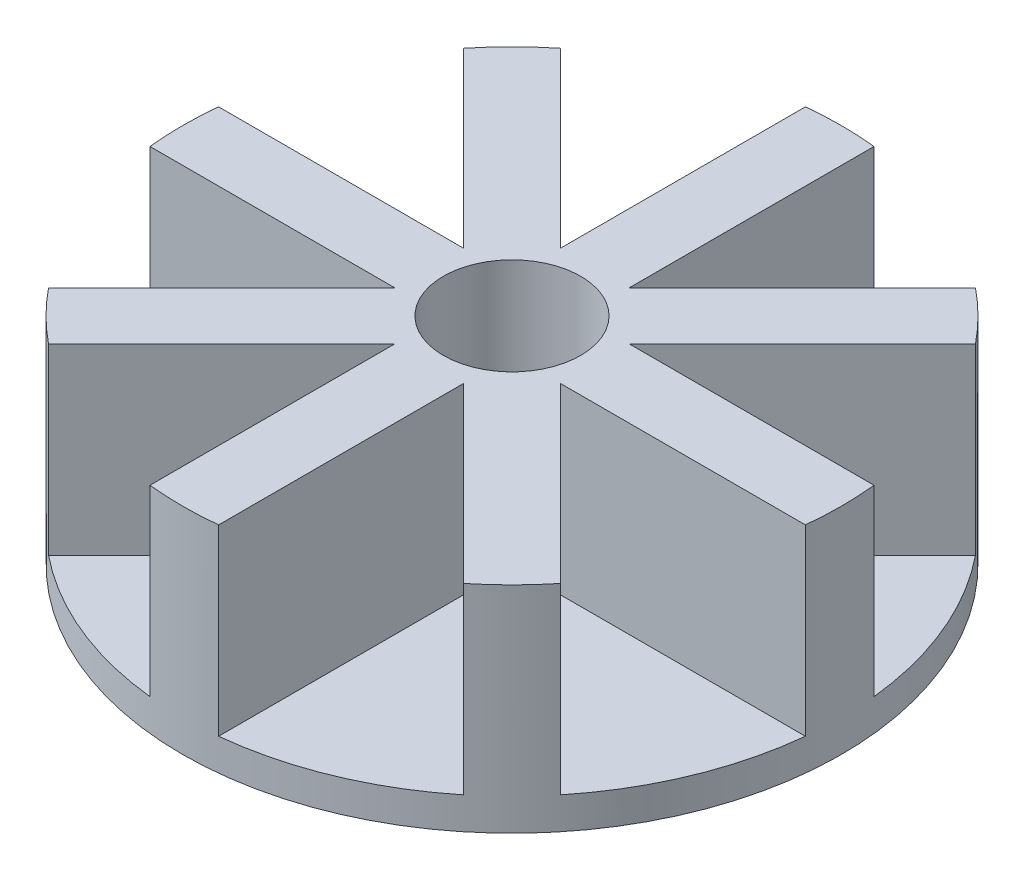
ISO-10303-21;
HEADER;
FILE_DESCRIPTION(('STEP AP214'),'2;1');
FILE_NAME('part.step','',(''),(''),'','','');
FILE_SCHEMA(('AUTOMOTIVE_DESIGN { 1 0 10303 214 1 1 1 1 }'));
ENDSEC;
DATA;
#1=APPLICATION_CONTEXT('core data for automotive mechanical design processes');
#2=APPLICATION_PROTOCOL_DEFINITION('international standard','automotive_design',2000,#1);
#3=PRODUCT_CONTEXT('',#1,'mechanical');
#4=PRODUCT('Part','Part','',(#3));
#5=PRODUCT_RELATED_PRODUCT_CATEGORY('part','',(#4));
#6=PRODUCT_DEFINITION_FORMATION('','',#4);
#7=PRODUCT_DEFINITION_CONTEXT('part definition',#1,'design');
#8=PRODUCT_DEFINITION('design','',#6,#7);
#9=PRODUCT_DEFINITION_SHAPE('','',#8);
#10=(LENGTH_UNIT() NAMED_UNIT(*) SI_UNIT(.MILLI.,.METRE.));
#11=(NAMED_UNIT(*) PLANE_ANGLE_UNIT() SI_UNIT($,.RADIAN.));
#12=(NAMED_UNIT(*) SI_UNIT($,.STERADIAN.) SOLID_ANGLE_UNIT());
#13=UNCERTAINTY_MEASURE_WITH_UNIT(LENGTH_MEASURE(1.E-05),#10,'distance_accuracy_value','');
#14=(GEOMETRIC_REPRESENTATION_CONTEXT(3) GLOBAL_UNCERTAINTY_ASSIGNED_CONTEXT((#13)) GLOBAL_UNIT_ASSIGNED_CONTEXT((#10,
#11,#12)) REPRESENTATION_CONTEXT('',''));
#15=CARTESIAN_POINT('',(0.,0.,0.));
#16=DIRECTION('',(0.,0.,1.));
#17=DIRECTION('',(1.,0.,0.));
#18=AXIS2_PLACEMENT_3D('',#15,#16,#17);
#19=CARTESIAN_POINT('',(0.,20.,0.));
#20=DIRECTION('',(0.,-1.,0.));
#21=DIRECTION('',(0.,0.,-1.));
#22=AXIS2_PLACEMENT_3D('',#19,#20,#21);
#23=CYLINDRICAL_SURFACE('',#22,4.);
#24=CARTESIAN_POINT('',(0.,0.,0.));
#25=DIRECTION('',(0.,-1.,0.));
#26=DIRECTION('',(0.,0.,-1.));
#27=AXIS2_PLACEMENT_3D('',#24,#25,#26);
#28=CIRCLE('',#27,4.);
#29=CARTESIAN_POINT('',(0.,0.,-4.));
#30=VERTEX_POINT('',#29);
#31=EDGE_CURVE('E416',#30,#30,#28,.T.);
#32=ORIENTED_EDGE('',*,*,#31,.T.);
#33=EDGE_LOOP('',(#32));
#34=FACE_BOUND('',#33,.T.);
#35=CARTESIAN_POINT('',(0.,14.,0.));
#36=DIRECTION('',(0.,1.,0.));
#37=DIRECTION('',(0.,0.,1.));
#38=AXIS2_PLACEMENT_3D('',#35,#36,#37);
#39=CIRCLE('',#38,4.);
#40=CARTESIAN_POINT('',(0.,14.,4.));
#41=VERTEX_POINT('',#40);
#42=EDGE_CURVE('E857',#41,#41,#39,.F.);
#43=ORIENTED_EDGE('',*,*,#42,.F.);
#44=EDGE_LOOP('',(#43));
#45=FACE_BOUND('',#44,.T.);
#46=ADVANCED_FACE('F105',(#34,#45),#23,.F.);
#47=CARTESIAN_POINT('',(15.5,94.001,-15.5));
#48=DIRECTION('',(0.,-1.,0.));
#49=DIRECTION('',(0.,0.,-1.));
#50=AXIS2_PLACEMENT_3D('',#47,#48,#49);
#51=CYLINDRICAL_SURFACE('',#50,1.4);
#52=CARTESIAN_POINT('',(15.5,0.,-15.5));
#53=DIRECTION('',(0.,-1.,0.));
#54=DIRECTION('',(0.,0.,-1.));
#55=AXIS2_PLACEMENT_3D('',#52,#53,#54);
#56=CIRCLE('',#55,1.4);
#57=CARTESIAN_POINT('',(15.5,0.,-16.9));
#58=VERTEX_POINT('',#57);
#59=EDGE_CURVE('E863',#58,#58,#56,.T.);
#60=ORIENTED_EDGE('',*,*,#59,.T.);
#61=EDGE_LOOP('',(#60));
#62=FACE_BOUND('',#61,.T.);
#63=CARTESIAN_POINT('',(15.5,14.,-15.5));
#64=DIRECTION('',(0.,1.,0.));
#65=DIRECTION('',(0.,0.,1.));
#66=AXIS2_PLACEMENT_3D('',#63,#64,#65);
#67=CIRCLE('',#66,1.4);
#68=CARTESIAN_POINT('',(15.5,14.,-14.1));
#69=VERTEX_POINT('',#68);
#70=EDGE_CURVE('E854',#69,#69,#67,.F.);
#71=ORIENTED_EDGE('',*,*,#70,.F.);
#72=EDGE_LOOP('',(#71));
#73=FACE_BOUND('',#72,.T.);
#74=ADVANCED_FACE('F466',(#62,#73),#51,.F.);
#75=CARTESIAN_POINT('',(15.5,94.001,15.5));
#76=DIRECTION('',(0.,-1.,0.));
#77=DIRECTION('',(0.,0.,-1.));
#78=AXIS2_PLACEMENT_3D('',#75,#76,#77);
#79=CYLINDRICAL_SURFACE('',#78,1.4);
#80=CARTESIAN_POINT('',(15.5,0.,15.5));
#81=DIRECTION('',(0.,-1.,0.));
#82=DIRECTION('',(0.,0.,-1.));
#83=AXIS2_PLACEMENT_3D('',#80,#81,#82);
#84=CIRCLE('',#83,1.4);
#85=CARTESIAN_POINT('',(15.5,0.,14.1));
#86=VERTEX_POINT('',#85);
#87=EDGE_CURVE('E860',#86,#86,#84,.T.);
#88=ORIENTED_EDGE('',*,*,#87,.T.);
#89=EDGE_LOOP('',(#88));
#90=FACE_BOUND('',#89,.T.);
#91=CARTESIAN_POINT('',(15.5,14.,15.5));
#92=DIRECTION('',(0.,1.,0.));
#93=DIRECTION('',(0.,0.,1.));
#94=AXIS2_PLACEMENT_3D('',#91,#92,#93);
#95=CIRCLE('',#94,1.4);
#96=CARTESIAN_POINT('',(15.5,14.,16.9));
#97=VERTEX_POINT('',#96);
#98=EDGE_CURVE('E843',#97,#97,#95,.F.);
#99=ORIENTED_EDGE('',*,*,#98,.F.);
#100=EDGE_LOOP('',(#99));
#101=FACE_BOUND('',#100,.T.);
#102=ADVANCED_FACE('F472',(#90,#101),#79,.F.);
#103=CARTESIAN_POINT('',(-15.5,94.001,15.5));
#104=DIRECTION('',(0.,-1.,0.));
#105=DIRECTION('',(0.,0.,-1.));
#106=AXIS2_PLACEMENT_3D('',#103,#104,#105);
#107=CYLINDRICAL_SURFACE('',#106,1.4);
#108=CARTESIAN_POINT('',(-15.5,0.,15.5));
#109=DIRECTION('',(0.,-1.,0.));
#110=DIRECTION('',(0.,0.,-1.));
#111=AXIS2_PLACEMENT_3D('',#108,#109,#110);
#112=CIRCLE('',#111,1.4);
#113=CARTESIAN_POINT('',(-15.5,0.,14.1));
#114=VERTEX_POINT('',#113);
#115=EDGE_CURVE('E864',#114,#114,#112,.T.);
#116=ORIENTED_EDGE('',*,*,#115,.T.);
#117=EDGE_LOOP('',(#116));
#118=FACE_BOUND('',#117,.T.);
#119=CARTESIAN_POINT('',(-15.5,14.,15.5));
#120=DIRECTION('',(0.,1.,0.));
#121=DIRECTION('',(0.,0.,1.));
#122=AXIS2_PLACEMENT_3D('',#119,#120,#121);
#123=CIRCLE('',#122,1.4);
#124=CARTESIAN_POINT('',(-15.5,14.,16.9));
#125=VERTEX_POINT('',#124);
#126=EDGE_CURVE('E840',#125,#125,#123,.F.);
#127=ORIENTED_EDGE('',*,*,#126,.F.);
#128=EDGE_LOOP('',(#127));
#129=FACE_BOUND('',#128,.T.);
#130=ADVANCED_FACE('F745',(#118,#129),#107,.F.);
#131=CARTESIAN_POINT('',(-15.5,94.001,-15.5));
#132=DIRECTION('',(0.,-1.,0.));
#133=DIRECTION('',(0.,0.,-1.));
#134=AXIS2_PLACEMENT_3D('',#131,#132,#133);
#135=CYLINDRICAL_SURFACE('',#134,1.4);
#136=CARTESIAN_POINT('',(-15.5,0.,-15.5));
#137=DIRECTION('',(0.,-1.,0.));
#138=DIRECTION('',(0.,0.,-1.));
#139=AXIS2_PLACEMENT_3D('',#136,#137,#138);
#140=CIRCLE('',#139,1.4);
#141=CARTESIAN_POINT('',(-15.5,0.,-16.9));
#142=VERTEX_POINT('',#141);
#143=EDGE_CURVE('E836',#142,#142,#140,.T.);
#144=ORIENTED_EDGE('',*,*,#143,.T.);
#145=EDGE_LOOP('',(#144));
#146=FACE_BOUND('',#145,.T.);
#147=CARTESIAN_POINT('',(-15.5,14.,-15.5));
#148=DIRECTION('',(0.,1.,0.));
#149=DIRECTION('',(0.,0.,1.));
#150=AXIS2_PLACEMENT_3D('',#147,#148,#149);
#151=CIRCLE('',#150,1.4);
#152=CARTESIAN_POINT('',(-15.5,14.,-14.1));
#153=VERTEX_POINT('',#152);
#154=EDGE_CURVE('E109',#153,#153,#151,.F.);
#155=ORIENTED_EDGE('',*,*,#154,.F.);
#156=EDGE_LOOP('',(#155));
#157=FACE_BOUND('',#156,.T.);
#158=ADVANCED_FACE('F754',(#146,#157),#135,.F.);
#159=CARTESIAN_POINT('',(0.,94.,0.));
#160=DIRECTION('',(0.,-1.,0.));
#161=DIRECTION('',(0.,0.,-1.));
#162=AXIS2_PLACEMENT_3D('',#159,#160,#161);
#163=CYLINDRICAL_SURFACE('',#162,144.);
#164=CARTESIAN_POINT('',(0.,0.,0.));
#165=DIRECTION('',(0.,1.,0.));
#166=DIRECTION('',(0.,0.,1.));
#167=AXIS2_PLACEMENT_3D('',#164,#165,#166);
#168=CIRCLE('',#167,144.);
#169=CARTESIAN_POINT('',(0.,0.,144.));
#170=VERTEX_POINT('',#169);
#171=EDGE_CURVE('E440',#170,#170,#168,.T.);
#172=ORIENTED_EDGE('',*,*,#171,.T.);
#173=EDGE_LOOP('',(#172));
#174=FACE_BOUND('',#173,.T.);
#175=DIRECTION('',(0.,1.,0.));
#176=VECTOR('',#175,1.);
#177=CARTESIAN_POINT('',(-111.876044295508,14.,-90.6628408599112));
#178=LINE('',#177,#176);
#179=CARTESIAN_POINT('',(-111.876044295508,14.,-90.6628408599112));
#180=VERTEX_POINT('',#179);
#181=CARTESIAN_POINT('',(-111.876044295508,94.,-90.6628408599112));
#182=VERTEX_POINT('',#181);
#183=EDGE_CURVE('E412',#180,#182,#178,.T.);
#184=ORIENTED_EDGE('',*,*,#183,.T.);
#185=CARTESIAN_POINT('',(0.,94.,0.));
#186=DIRECTION('',(0.,1.,0.));
#187=DIRECTION('',(0.,0.,1.));
#188=AXIS2_PLACEMENT_3D('',#185,#186,#187);
#189=CIRCLE('',#188,144.);
#190=CARTESIAN_POINT('',(-90.6628408599113,94.,-111.876044295508));
#191=VERTEX_POINT('',#190);
#192=EDGE_CURVE('E579',#191,#182,#189,.T.);
#193=ORIENTED_EDGE('',*,*,#192,.F.);
#194=DIRECTION('',(0.,1.,0.));
#195=VECTOR('',#194,1.);
#196=CARTESIAN_POINT('',(-90.6628408599113,14.,-111.876044295508));
#197=LINE('',#196,#195);
#198=CARTESIAN_POINT('',(-90.6628408599113,14.,-111.876044295508));
#199=VERTEX_POINT('',#198);
#200=EDGE_CURVE('E432',#199,#191,#197,.T.);
#201=ORIENTED_EDGE('',*,*,#200,.F.);
#202=CARTESIAN_POINT('',(0.,14.,0.));
#203=DIRECTION('',(0.,1.,0.));
#204=DIRECTION('',(0.,0.,1.));
#205=AXIS2_PLACEMENT_3D('',#202,#203,#204);
#206=CIRCLE('',#205,144.);
#207=CARTESIAN_POINT('',(-15.,14.,-143.21661914736));
#208=VERTEX_POINT('',#207);
#209=EDGE_CURVE('E423',#208,#199,#206,.T.);
#210=ORIENTED_EDGE('',*,*,#209,.F.);
#211=DIRECTION('',(0.,1.,0.));
#212=VECTOR('',#211,1.);
#213=CARTESIAN_POINT('',(-15.,14.,-143.21661914736));
#214=LINE('',#213,#212);
#215=CARTESIAN_POINT('',(-15.,94.,-143.21661914736));
#216=VERTEX_POINT('',#215);
#217=EDGE_CURVE('E437',#208,#216,#214,.T.);
#218=ORIENTED_EDGE('',*,*,#217,.T.);
#219=CARTESIAN_POINT('',(15.,94.,-143.21661914736));
#220=VERTEX_POINT('',#219);
#221=EDGE_CURVE('E575',#220,#216,#189,.T.);
#222=ORIENTED_EDGE('',*,*,#221,.F.);
#223=DIRECTION('',(0.,1.,0.));
#224=VECTOR('',#223,1.);
#225=CARTESIAN_POINT('',(15.,14.,-143.21661914736));
#226=LINE('',#225,#224);
#227=CARTESIAN_POINT('',(15.,14.,-143.21661914736));
#228=VERTEX_POINT('',#227);
#229=EDGE_CURVE('E324',#228,#220,#226,.T.);
#230=ORIENTED_EDGE('',*,*,#229,.F.);
#231=CARTESIAN_POINT('',(0.,14.,0.));
#232=DIRECTION('',(0.,1.,0.));
#233=DIRECTION('',(0.,0.,1.));
#234=AXIS2_PLACEMENT_3D('',#231,#232,#233);
#235=CIRCLE('',#234,144.);
#236=CARTESIAN_POINT('',(90.6628408599113,14.,-111.876044295508));
#237=VERTEX_POINT('',#236);
#238=EDGE_CURVE('E310',#237,#228,#235,.T.);
#239=ORIENTED_EDGE('',*,*,#238,.F.);
#240=DIRECTION('',(0.,1.,0.));
#241=VECTOR('',#240,1.);
#242=CARTESIAN_POINT('',(90.6628408599113,14.,-111.876044295508));
#243=LINE('',#242,#241);
#244=CARTESIAN_POINT('',(90.6628408599113,94.,-111.876044295508));
#245=VERTEX_POINT('',#244);
#246=EDGE_CURVE('E316',#237,#245,#243,.T.);
#247=ORIENTED_EDGE('',*,*,#246,.T.);
#248=CARTESIAN_POINT('',(111.876044295508,94.,-90.6628408599113));
#249=VERTEX_POINT('',#248);
#250=EDGE_CURVE('E582',#249,#245,#189,.T.);
#251=ORIENTED_EDGE('',*,*,#250,.F.);
#252=DIRECTION('',(0.,1.,0.));
#253=VECTOR('',#252,1.);
#254=CARTESIAN_POINT('',(111.876044295508,14.,-90.6628408599113));
#255=LINE('',#254,#253);
#256=CARTESIAN_POINT('',(111.876044295508,14.,-90.6628408599113));
#257=VERTEX_POINT('',#256);
#258=EDGE_CURVE('E283',#257,#249,#255,.T.);
#259=ORIENTED_EDGE('',*,*,#258,.F.);
#260=CARTESIAN_POINT('',(0.,14.,0.));
#261=DIRECTION('',(0.,1.,0.));
#262=DIRECTION('',(0.,0.,1.));
#263=AXIS2_PLACEMENT_3D('',#260,#261,#262);
#264=CIRCLE('',#263,144.);
#265=CARTESIAN_POINT('',(143.21661914736,14.,-15.));
#266=VERTEX_POINT('',#265);
#267=EDGE_CURVE('E289',#266,#257,#264,.T.);
#268=ORIENTED_EDGE('',*,*,#267,.F.);
#269=DIRECTION('',(0.,1.,0.));
#270=VECTOR('',#269,1.);
#271=CARTESIAN_POINT('',(143.21661914736,14.,-15.));
#272=LINE('',#271,#270);
#273=CARTESIAN_POINT('',(143.21661914736,94.,-15.));
#274=VERTEX_POINT('',#273);
#275=EDGE_CURVE('E272',#266,#274,#272,.T.);
#276=ORIENTED_EDGE('',*,*,#275,.T.);
#277=CARTESIAN_POINT('',(143.21661914736,94.,15.));
#278=VERTEX_POINT('',#277);
#279=EDGE_CURVE('E114',#278,#274,#189,.T.);
#280=ORIENTED_EDGE('',*,*,#279,.F.);
#281=DIRECTION('',(0.,1.,0.));
#282=VECTOR('',#281,1.);
#283=CARTESIAN_POINT('',(143.21661914736,14.,15.));
#284=LINE('',#283,#282);
#285=CARTESIAN_POINT('',(143.21661914736,14.,15.));
#286=VERTEX_POINT('',#285);
#287=EDGE_CURVE('E364',#286,#278,#284,.T.);
#288=ORIENTED_EDGE('',*,*,#287,.F.);
#289=CARTESIAN_POINT('',(0.,14.,0.));
#290=DIRECTION('',(0.,1.,0.));
#291=DIRECTION('',(0.,0.,1.));
#292=AXIS2_PLACEMENT_3D('',#289,#290,#291);
#293=CIRCLE('',#292,144.);
#294=CARTESIAN_POINT('',(111.876044295508,14.,90.6628408599112));
#295=VERTEX_POINT('',#294);
#296=EDGE_CURVE('E352',#295,#286,#293,.T.);
#297=ORIENTED_EDGE('',*,*,#296,.F.);
#298=DIRECTION('',(0.,1.,0.));
#299=VECTOR('',#298,1.);
#300=CARTESIAN_POINT('',(111.876044295508,14.,90.6628408599112));
#301=LINE('',#300,#299);
#302=CARTESIAN_POINT('',(111.876044295508,94.,90.6628408599112));
#303=VERTEX_POINT('',#302);
#304=EDGE_CURVE('E358',#295,#303,#301,.T.);
#305=ORIENTED_EDGE('',*,*,#304,.T.);
#306=CARTESIAN_POINT('',(90.6628408599113,94.,111.876044295508));
#307=VERTEX_POINT('',#306);
#308=EDGE_CURVE('E12',#307,#303,#189,.T.);
#309=ORIENTED_EDGE('',*,*,#308,.F.);
#310=DIRECTION('',(0.,1.,0.));
#311=VECTOR('',#310,1.);
#312=CARTESIAN_POINT('',(90.6628408599113,14.,111.876044295508));
#313=LINE('',#312,#311);
#314=CARTESIAN_POINT('',(90.6628408599113,14.,111.876044295508));
#315=VERTEX_POINT('',#314);
#316=EDGE_CURVE('E346',#315,#307,#313,.T.);
#317=ORIENTED_EDGE('',*,*,#316,.F.);
#318=CARTESIAN_POINT('',(0.,14.,0.));
#319=DIRECTION('',(0.,1.,0.));
#320=DIRECTION('',(0.,0.,1.));
#321=AXIS2_PLACEMENT_3D('',#318,#319,#320);
#322=CIRCLE('',#321,144.);
#323=CARTESIAN_POINT('',(15.,14.,143.21661914736));
#324=VERTEX_POINT('',#323);
#325=EDGE_CURVE('E330',#324,#315,#322,.T.);
#326=ORIENTED_EDGE('',*,*,#325,.F.);
#327=DIRECTION('',(0.,1.,0.));
#328=VECTOR('',#327,1.);
#329=CARTESIAN_POINT('',(15.,14.,143.21661914736));
#330=LINE('',#329,#328);
#331=CARTESIAN_POINT('',(15.,94.,143.21661914736));
#332=VERTEX_POINT('',#331);
#333=EDGE_CURVE('E336',#324,#332,#330,.T.);
#334=ORIENTED_EDGE('',*,*,#333,.T.);
#335=CARTESIAN_POINT('',(-15.,94.,143.21661914736));
#336=VERTEX_POINT('',#335);
#337=EDGE_CURVE('E116',#336,#332,#189,.T.);
#338=ORIENTED_EDGE('',*,*,#337,.F.);
#339=DIRECTION('',(0.,1.,0.));
#340=VECTOR('',#339,1.);
#341=CARTESIAN_POINT('',(-15.,14.,143.21661914736));
#342=LINE('',#341,#340);
#343=CARTESIAN_POINT('',(-15.,14.,143.21661914736));
#344=VERTEX_POINT('',#343);
#345=EDGE_CURVE('E123',#344,#336,#342,.T.);
#346=ORIENTED_EDGE('',*,*,#345,.F.);
#347=CARTESIAN_POINT('',(0.,14.,0.));
#348=DIRECTION('',(0.,1.,0.));
#349=DIRECTION('',(0.,0.,1.));
#350=AXIS2_PLACEMENT_3D('',#347,#348,#349);
#351=CIRCLE('',#350,144.);
#352=CARTESIAN_POINT('',(-90.6628408599113,14.,111.876044295508));
#353=VERTEX_POINT('',#352);
#354=EDGE_CURVE('E390',#353,#344,#351,.T.);
#355=ORIENTED_EDGE('',*,*,#354,.F.);
#356=DIRECTION('',(0.,1.,0.));
#357=VECTOR('',#356,1.);
#358=CARTESIAN_POINT('',(-90.6628408599113,14.,111.876044295508));
#359=LINE('',#358,#357);
#360=CARTESIAN_POINT('',(-90.6628408599113,94.,111.876044295508));
#361=VERTEX_POINT('',#360);
#362=EDGE_CURVE('E396',#353,#361,#359,.T.);
#363=ORIENTED_EDGE('',*,*,#362,.T.);
#364=CARTESIAN_POINT('',(-111.876044295508,94.,90.6628408599113));
#365=VERTEX_POINT('',#364);
#366=EDGE_CURVE('E444',#365,#361,#189,.T.);
#367=ORIENTED_EDGE('',*,*,#366,.F.);
#368=DIRECTION('',(0.,1.,0.));
#369=VECTOR('',#368,1.);
#370=CARTESIAN_POINT('',(-111.876044295508,14.,90.6628408599113));
#371=LINE('',#370,#369);
#372=CARTESIAN_POINT('',(-111.876044295508,14.,90.6628408599113));
#373=VERTEX_POINT('',#372);
#374=EDGE_CURVE('E131',#373,#365,#371,.T.);
#375=ORIENTED_EDGE('',*,*,#374,.F.);
#376=CARTESIAN_POINT('',(0.,14.,0.));
#377=DIRECTION('',(0.,1.,0.));
#378=DIRECTION('',(0.,0.,1.));
#379=AXIS2_PLACEMENT_3D('',#376,#377,#378);
#380=CIRCLE('',#379,144.);
#381=CARTESIAN_POINT('',(-143.21661914736,14.,15.));
#382=VERTEX_POINT('',#381);
#383=EDGE_CURVE('E370',#382,#373,#380,.T.);
#384=ORIENTED_EDGE('',*,*,#383,.F.);
#385=DIRECTION('',(0.,1.,0.));
#386=VECTOR('',#385,1.);
#387=CARTESIAN_POINT('',(-143.21661914736,14.,15.));
#388=LINE('',#387,#386);
#389=CARTESIAN_POINT('',(-143.21661914736,94.,15.));
#390=VERTEX_POINT('',#389);
#391=EDGE_CURVE('E376',#382,#390,#388,.T.);
#392=ORIENTED_EDGE('',*,*,#391,.T.);
#393=CARTESIAN_POINT('',(-143.21661914736,94.,-15.));
#394=VERTEX_POINT('',#393);
#395=EDGE_CURVE('E581',#394,#390,#189,.T.);
#396=ORIENTED_EDGE('',*,*,#395,.F.);
#397=DIRECTION('',(0.,1.,0.));
#398=VECTOR('',#397,1.);
#399=CARTESIAN_POINT('',(-143.21661914736,14.,-15.));
#400=LINE('',#399,#398);
#401=CARTESIAN_POINT('',(-143.21661914736,14.,-15.));
#402=VERTEX_POINT('',#401);
#403=EDGE_CURVE('E420',#402,#394,#400,.T.);
#404=ORIENTED_EDGE('',*,*,#403,.F.);
#405=CARTESIAN_POINT('',(0.,14.,0.));
#406=DIRECTION('',(0.,1.,0.));
#407=DIRECTION('',(0.,0.,1.));
#408=AXIS2_PLACEMENT_3D('',#405,#406,#407);
#409=CIRCLE('',#408,144.);
#410=EDGE_CURVE('E406',#180,#402,#409,.T.);
#411=ORIENTED_EDGE('',*,*,#410,.F.);
#412=EDGE_LOOP('',(#184,#193,#201,#210,#218,#222,#230,#239,#247,#251,#259,#268,#276,#280,#288,
#297,#305,#309,#317,#326,#334,#338,#346,#355,#363,#367,#375,#384,#392,#396,#404,#411));
#413=FACE_BOUND('',#412,.T.);
#414=ADVANCED_FACE('F107',(#174,#413),#163,.T.);
#415=CARTESIAN_POINT('',(0.,94.,0.));
#416=DIRECTION('',(0.,1.,0.));
#417=DIRECTION('',(0.,0.,1.));
#418=AXIS2_PLACEMENT_3D('',#415,#416,#417);
#419=PLANE('',#418);
#420=CARTESIAN_POINT('',(0.,94.,0.));
#421=DIRECTION('',(0.,1.,0.));
#422=DIRECTION('',(0.,0.,1.));
#423=AXIS2_PLACEMENT_3D('',#420,#421,#422);
#424=CIRCLE('',#423,30.);
#425=CARTESIAN_POINT('',(0.,94.,30.));
#426=VERTEX_POINT('',#425);
#427=EDGE_CURVE('E846',#426,#426,#424,.T.);
#428=ORIENTED_EDGE('',*,*,#427,.F.);
#429=EDGE_LOOP('',(#428));
#430=FACE_BOUND('',#429,.T.);
#431=ORIENTED_EDGE('',*,*,#192,.T.);
#432=DIRECTION('',(0.70710678118655,0.,0.707106781186545));
#433=VECTOR('',#432,1.);
#434=CARTESIAN_POINT('',(-10.6066017177978,94.,10.6066017177979));
#435=LINE('',#434,#433);
#436=CARTESIAN_POINT('',(-36.2132034355962,94.,-15.0000000000003));
#437=VERTEX_POINT('',#436);
#438=EDGE_CURVE('E413',#182,#437,#435,.T.);
#439=ORIENTED_EDGE('',*,*,#438,.T.);
#440=DIRECTION('',(1.,0.,0.));
#441=VECTOR('',#440,1.);
#442=CARTESIAN_POINT('',(0.,94.,-15.0000000000004));
#443=LINE('',#442,#441);
#444=EDGE_CURVE('E407',#394,#437,#443,.T.);
#445=ORIENTED_EDGE('',*,*,#444,.F.);
#446=ORIENTED_EDGE('',*,*,#395,.T.);
#447=DIRECTION('',(1.,0.,0.));
#448=VECTOR('',#447,1.);
#449=CARTESIAN_POINT('',(0.,94.,14.9999999999996));
#450=LINE('',#449,#448);
#451=CARTESIAN_POINT('',(-36.2132034355965,94.,14.9999999999997));
#452=VERTEX_POINT('',#451);
#453=EDGE_CURVE('E377',#390,#452,#450,.T.);
#454=ORIENTED_EDGE('',*,*,#453,.T.);
#455=DIRECTION('',(0.707106781186546,0.,-0.707106781186549));
#456=VECTOR('',#455,1.);
#457=CARTESIAN_POINT('',(-10.6066017177985,94.,-10.6066017177984));
#458=LINE('',#457,#456);
#459=EDGE_CURVE('E371',#365,#452,#458,.T.);
#460=ORIENTED_EDGE('',*,*,#459,.F.);
#461=ORIENTED_EDGE('',*,*,#366,.T.);
#462=DIRECTION('',(0.707106781186546,0.,-0.70710678118655));
#463=VECTOR('',#462,1.);
#464=CARTESIAN_POINT('',(10.606601717798,94.,10.6066017177979));
#465=LINE('',#464,#463);
#466=CARTESIAN_POINT('',(-15.0000000000002,94.,36.2132034355963));
#467=VERTEX_POINT('',#466);
#468=EDGE_CURVE('E384',#361,#467,#465,.T.);
#469=ORIENTED_EDGE('',*,*,#468,.T.);
#470=DIRECTION('',(0.,0.,-1.));
#471=VECTOR('',#470,1.);
#472=CARTESIAN_POINT('',(-15.0000000000003,94.,0.));
#473=LINE('',#472,#471);
#474=EDGE_CURVE('E391',#336,#467,#473,.T.);
#475=ORIENTED_EDGE('',*,*,#474,.F.);
#476=ORIENTED_EDGE('',*,*,#337,.T.);
#477=DIRECTION('',(0.,0.,-1.));
#478=VECTOR('',#477,1.);
#479=CARTESIAN_POINT('',(14.9999999999997,94.,0.));
#480=LINE('',#479,#478);
#481=CARTESIAN_POINT('',(14.9999999999998,94.,36.2132034355964));
#482=VERTEX_POINT('',#481);
#483=EDGE_CURVE('E337',#332,#482,#480,.T.);
#484=ORIENTED_EDGE('',*,*,#483,.T.);
#485=DIRECTION('',(-0.707106781186549,0.,-0.707106781186546));
#486=VECTOR('',#485,1.);
#487=CARTESIAN_POINT('',(-10.6066017177983,94.,10.6066017177984));
#488=LINE('',#487,#486);
#489=EDGE_CURVE('E331',#307,#482,#488,.T.);
#490=ORIENTED_EDGE('',*,*,#489,.F.);
#491=ORIENTED_EDGE('',*,*,#308,.T.);
#492=DIRECTION('',(-0.707106781186549,0.,-0.707106781186546));
#493=VECTOR('',#492,1.);
#494=CARTESIAN_POINT('',(10.606601717798,94.,-10.6066017177981));
#495=LINE('',#494,#493);
#496=CARTESIAN_POINT('',(36.2132034355963,94.,15.0000000000001));
#497=VERTEX_POINT('',#496);
#498=EDGE_CURVE('E345',#303,#497,#495,.T.);
#499=ORIENTED_EDGE('',*,*,#498,.T.);
#500=DIRECTION('',(-1.,0.,0.));
#501=VECTOR('',#500,1.);
#502=CARTESIAN_POINT('',(0.,94.,15.0000000000001));
#503=LINE('',#502,#501);
#504=EDGE_CURVE('E353',#278,#497,#503,.T.);
#505=ORIENTED_EDGE('',*,*,#504,.F.);
#506=ORIENTED_EDGE('',*,*,#279,.T.);
#507=DIRECTION('',(-1.,0.,0.));
#508=VECTOR('',#507,1.);
#509=CARTESIAN_POINT('',(0.,94.,-14.9999999999999));
#510=LINE('',#509,#508);
#511=CARTESIAN_POINT('',(36.2132034355964,94.,-14.9999999999999));
#512=VERTEX_POINT('',#511);
#513=EDGE_CURVE('E278',#274,#512,#510,.T.);
#514=ORIENTED_EDGE('',*,*,#513,.T.);
#515=DIRECTION('',(-0.707106781186547,0.,0.707106781186548));
#516=VECTOR('',#515,1.);
#517=CARTESIAN_POINT('',(10.6066017177983,94.,10.6066017177982));
#518=LINE('',#517,#516);
#519=EDGE_CURVE('E291',#249,#512,#518,.T.);
#520=ORIENTED_EDGE('',*,*,#519,.F.);
#521=ORIENTED_EDGE('',*,*,#250,.T.);
#522=DIRECTION('',(-0.707106781186547,0.,0.707106781186548));
#523=VECTOR('',#522,1.);
#524=CARTESIAN_POINT('',(-10.6066017177982,94.,-10.6066017177981));
#525=LINE('',#524,#523);
#526=CARTESIAN_POINT('',(15.,94.,-36.2132034355963));
#527=VERTEX_POINT('',#526);
#528=EDGE_CURVE('E306',#245,#527,#525,.T.);
#529=ORIENTED_EDGE('',*,*,#528,.T.);
#530=DIRECTION('',(0.,0.,1.));
#531=VECTOR('',#530,1.);
#532=CARTESIAN_POINT('',(15.,94.,0.));
#533=LINE('',#532,#531);
#534=EDGE_CURVE('E311',#220,#527,#533,.T.);
#535=ORIENTED_EDGE('',*,*,#534,.F.);
#536=ORIENTED_EDGE('',*,*,#221,.T.);
#537=DIRECTION('',(0.,0.,1.));
#538=VECTOR('',#537,1.);
#539=CARTESIAN_POINT('',(-15.,94.,0.));
#540=LINE('',#539,#538);
#541=CARTESIAN_POINT('',(-15.,94.,-36.2132034355969));
#542=VERTEX_POINT('',#541);
#543=EDGE_CURVE('E427',#216,#542,#540,.T.);
#544=ORIENTED_EDGE('',*,*,#543,.T.);
#545=DIRECTION('',(0.70710678118655,0.,0.707106781186545));
#546=VECTOR('',#545,1.);
#547=CARTESIAN_POINT('',(10.6066017177985,94.,-10.6066017177986));
#548=LINE('',#547,#546);
#549=EDGE_CURVE('E323',#191,#542,#548,.T.);
#550=ORIENTED_EDGE('',*,*,#549,.F.);
#551=EDGE_LOOP('',(#431,#439,#445,#446,#454,#460,#461,#469,#475,#476,#484,#490,#491,#499,#505,
#506,#514,#520,#521,#529,#535,#536,#544,#550));
#552=FACE_BOUND('',#551,.T.);
#553=ADVANCED_FACE('F452',(#430,#552),#419,.T.);
#554=CARTESIAN_POINT('',(0.,0.,0.));
#555=DIRECTION('',(0.,1.,0.));
#556=DIRECTION('',(0.,0.,1.));
#557=AXIS2_PLACEMENT_3D('',#554,#555,#556);
#558=PLANE('',#557);
#559=ORIENTED_EDGE('',*,*,#143,.F.);
#560=EDGE_LOOP('',(#559));
#561=FACE_BOUND('',#560,.T.);
#562=ORIENTED_EDGE('',*,*,#115,.F.);
#563=EDGE_LOOP('',(#562));
#564=FACE_BOUND('',#563,.T.);
#565=ORIENTED_EDGE('',*,*,#87,.F.);
#566=EDGE_LOOP('',(#565));
#567=FACE_BOUND('',#566,.T.);
#568=ORIENTED_EDGE('',*,*,#59,.F.);
#569=EDGE_LOOP('',(#568));
#570=FACE_BOUND('',#569,.T.);
#571=ORIENTED_EDGE('',*,*,#31,.F.);
#572=EDGE_LOOP('',(#571));
#573=FACE_BOUND('',#572,.T.);
#574=ORIENTED_EDGE('',*,*,#171,.F.);
#575=EDGE_LOOP('',(#574));
#576=FACE_BOUND('',#575,.T.);
#577=ADVANCED_FACE('F449',(#561,#564,#567,#570,#573,#576),#558,.F.);
#578=CARTESIAN_POINT('',(-15.,14.,0.));
#579=DIRECTION('',(-1.,0.,0.));
#580=DIRECTION('',(0.,0.,1.));
#581=AXIS2_PLACEMENT_3D('',#578,#579,#580);
#582=PLANE('',#581);
#583=ORIENTED_EDGE('',*,*,#543,.F.);
#584=ORIENTED_EDGE('',*,*,#217,.F.);
#585=DIRECTION('',(0.,0.,1.));
#586=VECTOR('',#585,1.);
#587=CARTESIAN_POINT('',(-15.,14.,0.));
#588=LINE('',#587,#586);
#589=CARTESIAN_POINT('',(-15.,14.,-36.2132034355969));
#590=VERTEX_POINT('',#589);
#591=EDGE_CURVE('E430',#208,#590,#588,.T.);
#592=ORIENTED_EDGE('',*,*,#591,.T.);
#593=DIRECTION('',(0.,1.,0.));
#594=VECTOR('',#593,1.);
#595=CARTESIAN_POINT('',(-15.,14.,-36.2132034355969));
#596=LINE('',#595,#594);
#597=EDGE_CURVE('E441',#590,#542,#596,.T.);
#598=ORIENTED_EDGE('',*,*,#597,.T.);
#599=EDGE_LOOP('',(#583,#584,#592,#598));
#600=FACE_BOUND('',#599,.T.);
#601=ADVANCED_FACE('F451',(#600),#582,.T.);
#602=CARTESIAN_POINT('',(10.6066017177985,14.,-10.6066017177986));
#603=DIRECTION('',(-0.707106781186545,0.,0.70710678118655));
#604=DIRECTION('',(0.70710678118655,0.,0.707106781186545));
#605=AXIS2_PLACEMENT_3D('',#602,#603,#604);
#606=PLANE('',#605);
#607=ORIENTED_EDGE('',*,*,#549,.T.);
#608=ORIENTED_EDGE('',*,*,#597,.F.);
#609=DIRECTION('',(0.70710678118655,0.,0.707106781186545));
#610=VECTOR('',#609,1.);
#611=CARTESIAN_POINT('',(10.6066017177985,14.,-10.6066017177986));
#612=LINE('',#611,#610);
#613=EDGE_CURVE('E426',#199,#590,#612,.T.);
#614=ORIENTED_EDGE('',*,*,#613,.F.);
#615=ORIENTED_EDGE('',*,*,#200,.T.);
#616=EDGE_LOOP('',(#607,#608,#614,#615));
#617=FACE_BOUND('',#616,.T.);
#618=ADVANCED_FACE('F458',(#617),#606,.F.);
#619=CARTESIAN_POINT('',(0.,14.,0.));
#620=DIRECTION('',(0.,1.,0.));
#621=DIRECTION('',(0.,0.,1.));
#622=AXIS2_PLACEMENT_3D('',#619,#620,#621);
#623=PLANE('',#622);
#624=ORIENTED_EDGE('',*,*,#209,.T.);
#625=ORIENTED_EDGE('',*,*,#613,.T.);
#626=ORIENTED_EDGE('',*,*,#591,.F.);
#627=EDGE_LOOP('',(#624,#625,#626));
#628=FACE_BOUND('',#627,.T.);
#629=ADVANCED_FACE('F488',(#628),#623,.T.);
#630=CARTESIAN_POINT('',(0.,14.,-14.9999999999999));
#631=DIRECTION('',(0.,0.,-1.));
#632=DIRECTION('',(-1.,0.,0.));
#633=AXIS2_PLACEMENT_3D('',#630,#631,#632);
#634=PLANE('',#633);
#635=ORIENTED_EDGE('',*,*,#513,.F.);
#636=ORIENTED_EDGE('',*,*,#275,.F.);
#637=DIRECTION('',(-1.,0.,0.));
#638=VECTOR('',#637,1.);
#639=CARTESIAN_POINT('',(0.,14.,-14.9999999999999));
#640=LINE('',#639,#638);
#641=CARTESIAN_POINT('',(36.2132034355964,14.,-14.9999999999999));
#642=VERTEX_POINT('',#641);
#643=EDGE_CURVE('E275',#266,#642,#640,.T.);
#644=ORIENTED_EDGE('',*,*,#643,.T.);
#645=DIRECTION('',(0.,1.,0.));
#646=VECTOR('',#645,1.);
#647=CARTESIAN_POINT('',(36.2132034355964,14.,-14.9999999999999));
#648=LINE('',#647,#646);
#649=EDGE_CURVE('E304',#642,#512,#648,.T.);
#650=ORIENTED_EDGE('',*,*,#649,.T.);
#651=EDGE_LOOP('',(#635,#636,#644,#650));
#652=FACE_BOUND('',#651,.T.);
#653=ADVANCED_FACE('F274',(#652),#634,.T.);
#654=CARTESIAN_POINT('',(10.6066017177983,14.,10.6066017177982));
#655=DIRECTION('',(-0.707106781186548,0.,-0.707106781186547));
#656=DIRECTION('',(-0.707106781186547,0.,0.707106781186548));
#657=AXIS2_PLACEMENT_3D('',#654,#655,#656);
#658=PLANE('',#657);
#659=ORIENTED_EDGE('',*,*,#519,.T.);
#660=ORIENTED_EDGE('',*,*,#649,.F.);
#661=DIRECTION('',(-0.707106781186547,0.,0.707106781186548));
#662=VECTOR('',#661,1.);
#663=CARTESIAN_POINT('',(10.6066017177983,14.,10.6066017177982));
#664=LINE('',#663,#662);
#665=EDGE_CURVE('E284',#257,#642,#664,.T.);
#666=ORIENTED_EDGE('',*,*,#665,.F.);
#667=ORIENTED_EDGE('',*,*,#258,.T.);
#668=EDGE_LOOP('',(#659,#660,#666,#667));
#669=FACE_BOUND('',#668,.T.);
#670=ADVANCED_FACE('F482',(#669),#658,.F.);
#671=CARTESIAN_POINT('',(0.,14.,0.));
#672=DIRECTION('',(0.,1.,0.));
#673=DIRECTION('',(0.,0.,1.));
#674=AXIS2_PLACEMENT_3D('',#671,#672,#673);
#675=PLANE('',#674);
#676=ORIENTED_EDGE('',*,*,#643,.F.);
#677=ORIENTED_EDGE('',*,*,#267,.T.);
#678=ORIENTED_EDGE('',*,*,#665,.T.);
#679=EDGE_LOOP('',(#676,#677,#678));
#680=FACE_BOUND('',#679,.T.);
#681=ADVANCED_FACE('F288',(#680),#675,.T.);
#682=CARTESIAN_POINT('',(-10.6066017177982,14.,-10.6066017177981));
#683=DIRECTION('',(-0.707106781186548,0.,-0.707106781186547));
#684=DIRECTION('',(-0.707106781186547,0.,0.707106781186548));
#685=AXIS2_PLACEMENT_3D('',#682,#683,#684);
#686=PLANE('',#685);
#687=ORIENTED_EDGE('',*,*,#528,.F.);
#688=ORIENTED_EDGE('',*,*,#246,.F.);
#689=DIRECTION('',(-0.707106781186547,0.,0.707106781186548));
#690=VECTOR('',#689,1.);
#691=CARTESIAN_POINT('',(-10.6066017177982,14.,-10.6066017177981));
#692=LINE('',#691,#690);
#693=CARTESIAN_POINT('',(15.,14.,-36.2132034355963));
#694=VERTEX_POINT('',#693);
#695=EDGE_CURVE('E308',#237,#694,#692,.T.);
#696=ORIENTED_EDGE('',*,*,#695,.T.);
#697=DIRECTION('',(0.,1.,0.));
#698=VECTOR('',#697,1.);
#699=CARTESIAN_POINT('',(15.,14.,-36.2132034355963));
#700=LINE('',#699,#698);
#701=EDGE_CURVE('E321',#694,#527,#700,.T.);
#702=ORIENTED_EDGE('',*,*,#701,.T.);
#703=EDGE_LOOP('',(#687,#688,#696,#702));
#704=FACE_BOUND('',#703,.T.);
#705=ADVANCED_FACE('F481',(#704),#686,.T.);
#706=CARTESIAN_POINT('',(15.,14.,0.));
#707=DIRECTION('',(-1.,0.,0.));
#708=DIRECTION('',(0.,0.,1.));
#709=AXIS2_PLACEMENT_3D('',#706,#707,#708);
#710=PLANE('',#709);
#711=ORIENTED_EDGE('',*,*,#534,.T.);
#712=ORIENTED_EDGE('',*,*,#701,.F.);
#713=DIRECTION('',(0.,0.,1.));
#714=VECTOR('',#713,1.);
#715=CARTESIAN_POINT('',(15.,14.,0.));
#716=LINE('',#715,#714);
#717=EDGE_CURVE('E313',#228,#694,#716,.T.);
#718=ORIENTED_EDGE('',*,*,#717,.F.);
#719=ORIENTED_EDGE('',*,*,#229,.T.);
#720=EDGE_LOOP('',(#711,#712,#718,#719));
#721=FACE_BOUND('',#720,.T.);
#722=ADVANCED_FACE('F493',(#721),#710,.F.);
#723=CARTESIAN_POINT('',(0.,14.,0.));
#724=DIRECTION('',(0.,1.,0.));
#725=DIRECTION('',(0.,0.,1.));
#726=AXIS2_PLACEMENT_3D('',#723,#724,#725);
#727=PLANE('',#726);
#728=ORIENTED_EDGE('',*,*,#695,.F.);
#729=ORIENTED_EDGE('',*,*,#238,.T.);
#730=ORIENTED_EDGE('',*,*,#717,.T.);
#731=EDGE_LOOP('',(#728,#729,#730));
#732=FACE_BOUND('',#731,.T.);
#733=ADVANCED_FACE('F489',(#732),#727,.T.);
#734=CARTESIAN_POINT('',(14.9999999999997,14.,0.));
#735=DIRECTION('',(1.,0.,0.));
#736=DIRECTION('',(0.,0.,-1.));
#737=AXIS2_PLACEMENT_3D('',#734,#735,#736);
#738=PLANE('',#737);
#739=ORIENTED_EDGE('',*,*,#483,.F.);
#740=ORIENTED_EDGE('',*,*,#333,.F.);
#741=DIRECTION('',(0.,0.,-1.));
#742=VECTOR('',#741,1.);
#743=CARTESIAN_POINT('',(14.9999999999997,14.,0.));
#744=LINE('',#743,#742);
#745=CARTESIAN_POINT('',(14.9999999999998,14.,36.2132034355964));
#746=VERTEX_POINT('',#745);
#747=EDGE_CURVE('E328',#324,#746,#744,.T.);
#748=ORIENTED_EDGE('',*,*,#747,.T.);
#749=DIRECTION('',(0.,1.,0.));
#750=VECTOR('',#749,1.);
#751=CARTESIAN_POINT('',(14.9999999999998,14.,36.2132034355964));
#752=LINE('',#751,#750);
#753=EDGE_CURVE('E343',#746,#482,#752,.T.);
#754=ORIENTED_EDGE('',*,*,#753,.T.);
#755=EDGE_LOOP('',(#739,#740,#748,#754));
#756=FACE_BOUND('',#755,.T.);
#757=ADVANCED_FACE('F492',(#756),#738,.T.);
#758=CARTESIAN_POINT('',(-10.6066017177983,14.,10.6066017177984));
#759=DIRECTION('',(0.707106781186546,0.,-0.707106781186549));
#760=DIRECTION('',(-0.707106781186549,0.,-0.707106781186546));
#761=AXIS2_PLACEMENT_3D('',#758,#759,#760);
#762=PLANE('',#761);
#763=ORIENTED_EDGE('',*,*,#489,.T.);
#764=ORIENTED_EDGE('',*,*,#753,.F.);
#765=DIRECTION('',(-0.707106781186549,0.,-0.707106781186546));
#766=VECTOR('',#765,1.);
#767=CARTESIAN_POINT('',(-10.6066017177983,14.,10.6066017177984));
#768=LINE('',#767,#766);
#769=EDGE_CURVE('E333',#315,#746,#768,.T.);
#770=ORIENTED_EDGE('',*,*,#769,.F.);
#771=ORIENTED_EDGE('',*,*,#316,.T.);
#772=EDGE_LOOP('',(#763,#764,#770,#771));
#773=FACE_BOUND('',#772,.T.);
#774=ADVANCED_FACE('F505',(#773),#762,.F.);
#775=CARTESIAN_POINT('',(0.,14.,0.));
#776=DIRECTION('',(0.,1.,0.));
#777=DIRECTION('',(0.,0.,1.));
#778=AXIS2_PLACEMENT_3D('',#775,#776,#777);
#779=PLANE('',#778);
#780=ORIENTED_EDGE('',*,*,#747,.F.);
#781=ORIENTED_EDGE('',*,*,#325,.T.);
#782=ORIENTED_EDGE('',*,*,#769,.T.);
#783=EDGE_LOOP('',(#780,#781,#782));
#784=FACE_BOUND('',#783,.T.);
#785=ADVANCED_FACE('F501',(#784),#779,.T.);
#786=CARTESIAN_POINT('',(10.606601717798,14.,-10.6066017177981));
#787=DIRECTION('',(0.707106781186546,0.,-0.707106781186549));
#788=DIRECTION('',(-0.707106781186549,0.,-0.707106781186546));
#789=AXIS2_PLACEMENT_3D('',#786,#787,#788);
#790=PLANE('',#789);
#791=ORIENTED_EDGE('',*,*,#498,.F.);
#792=ORIENTED_EDGE('',*,*,#304,.F.);
#793=DIRECTION('',(-0.707106781186549,0.,-0.707106781186546));
#794=VECTOR('',#793,1.);
#795=CARTESIAN_POINT('',(10.606601717798,14.,-10.6066017177981));
#796=LINE('',#795,#794);
#797=CARTESIAN_POINT('',(36.2132034355963,14.,15.0000000000001));
#798=VERTEX_POINT('',#797);
#799=EDGE_CURVE('E350',#295,#798,#796,.T.);
#800=ORIENTED_EDGE('',*,*,#799,.T.);
#801=DIRECTION('',(0.,1.,0.));
#802=VECTOR('',#801,1.);
#803=CARTESIAN_POINT('',(36.2132034355963,14.,15.0000000000001));
#804=LINE('',#803,#802);
#805=EDGE_CURVE('E301',#798,#497,#804,.T.);
#806=ORIENTED_EDGE('',*,*,#805,.T.);
#807=EDGE_LOOP('',(#791,#792,#800,#806));
#808=FACE_BOUND('',#807,.T.);
#809=ADVANCED_FACE('F504',(#808),#790,.T.);
#810=CARTESIAN_POINT('',(0.,14.,15.0000000000001));
#811=DIRECTION('',(0.,0.,-1.));
#812=DIRECTION('',(-1.,0.,0.));
#813=AXIS2_PLACEMENT_3D('',#810,#811,#812);
#814=PLANE('',#813);
#815=ORIENTED_EDGE('',*,*,#504,.T.);
#816=ORIENTED_EDGE('',*,*,#805,.F.);
#817=DIRECTION('',(-1.,0.,0.));
#818=VECTOR('',#817,1.);
#819=CARTESIAN_POINT('',(0.,14.,15.0000000000001));
#820=LINE('',#819,#818);
#821=EDGE_CURVE('E355',#286,#798,#820,.T.);
#822=ORIENTED_EDGE('',*,*,#821,.F.);
#823=ORIENTED_EDGE('',*,*,#287,.T.);
#824=EDGE_LOOP('',(#815,#816,#822,#823));
#825=FACE_BOUND('',#824,.T.);
#826=ADVANCED_FACE('F517',(#825),#814,.F.);
#827=CARTESIAN_POINT('',(0.,14.,0.));
#828=DIRECTION('',(0.,1.,0.));
#829=DIRECTION('',(0.,0.,1.));
#830=AXIS2_PLACEMENT_3D('',#827,#828,#829);
#831=PLANE('',#830);
#832=ORIENTED_EDGE('',*,*,#799,.F.);
#833=ORIENTED_EDGE('',*,*,#296,.T.);
#834=ORIENTED_EDGE('',*,*,#821,.T.);
#835=EDGE_LOOP('',(#832,#833,#834));
#836=FACE_BOUND('',#835,.T.);
#837=ADVANCED_FACE('F513',(#836),#831,.T.);
#838=CARTESIAN_POINT('',(0.,14.,14.9999999999996));
#839=DIRECTION('',(0.,0.,1.));
#840=DIRECTION('',(1.,0.,0.));
#841=AXIS2_PLACEMENT_3D('',#838,#839,#840);
#842=PLANE('',#841);
#843=ORIENTED_EDGE('',*,*,#453,.F.);
#844=ORIENTED_EDGE('',*,*,#391,.F.);
#845=DIRECTION('',(1.,0.,0.));
#846=VECTOR('',#845,1.);
#847=CARTESIAN_POINT('',(0.,14.,14.9999999999996));
#848=LINE('',#847,#846);
#849=CARTESIAN_POINT('',(-36.2132034355965,14.,14.9999999999997));
#850=VERTEX_POINT('',#849);
#851=EDGE_CURVE('E368',#382,#850,#848,.T.);
#852=ORIENTED_EDGE('',*,*,#851,.T.);
#853=DIRECTION('',(0.,1.,0.));
#854=VECTOR('',#853,1.);
#855=CARTESIAN_POINT('',(-36.2132034355965,14.,14.9999999999997));
#856=LINE('',#855,#854);
#857=EDGE_CURVE('E382',#850,#452,#856,.T.);
#858=ORIENTED_EDGE('',*,*,#857,.T.);
#859=EDGE_LOOP('',(#843,#844,#852,#858));
#860=FACE_BOUND('',#859,.T.);
#861=ADVANCED_FACE('F516',(#860),#842,.T.);
#862=CARTESIAN_POINT('',(-10.6066017177985,14.,-10.6066017177984));
#863=DIRECTION('',(0.707106781186549,0.,0.707106781186546));
#864=DIRECTION('',(0.707106781186546,0.,-0.707106781186549));
#865=AXIS2_PLACEMENT_3D('',#862,#863,#864);
#866=PLANE('',#865);
#867=ORIENTED_EDGE('',*,*,#459,.T.);
#868=ORIENTED_EDGE('',*,*,#857,.F.);
#869=DIRECTION('',(0.707106781186546,0.,-0.707106781186549));
#870=VECTOR('',#869,1.);
#871=CARTESIAN_POINT('',(-10.6066017177985,14.,-10.6066017177984));
#872=LINE('',#871,#870);
#873=EDGE_CURVE('E373',#373,#850,#872,.T.);
#874=ORIENTED_EDGE('',*,*,#873,.F.);
#875=ORIENTED_EDGE('',*,*,#374,.T.);
#876=EDGE_LOOP('',(#867,#868,#874,#875));
#877=FACE_BOUND('',#876,.T.);
#878=ADVANCED_FACE('F529',(#877),#866,.F.);
#879=CARTESIAN_POINT('',(0.,14.,0.));
#880=DIRECTION('',(0.,1.,0.));
#881=DIRECTION('',(0.,0.,1.));
#882=AXIS2_PLACEMENT_3D('',#879,#880,#881);
#883=PLANE('',#882);
#884=ORIENTED_EDGE('',*,*,#851,.F.);
#885=ORIENTED_EDGE('',*,*,#383,.T.);
#886=ORIENTED_EDGE('',*,*,#873,.T.);
#887=EDGE_LOOP('',(#884,#885,#886));
#888=FACE_BOUND('',#887,.T.);
#889=ADVANCED_FACE('F525',(#888),#883,.T.);
#890=CARTESIAN_POINT('',(10.606601717798,14.,10.6066017177979));
#891=DIRECTION('',(0.70710678118655,0.,0.707106781186546));
#892=DIRECTION('',(0.707106781186546,0.,-0.70710678118655));
#893=AXIS2_PLACEMENT_3D('',#890,#891,#892);
#894=PLANE('',#893);
#895=ORIENTED_EDGE('',*,*,#468,.F.);
#896=ORIENTED_EDGE('',*,*,#362,.F.);
#897=DIRECTION('',(0.707106781186546,0.,-0.70710678118655));
#898=VECTOR('',#897,1.);
#899=CARTESIAN_POINT('',(10.606601717798,14.,10.6066017177979));
#900=LINE('',#899,#898);
#901=CARTESIAN_POINT('',(-15.0000000000002,14.,36.2132034355963));
#902=VERTEX_POINT('',#901);
#903=EDGE_CURVE('E388',#353,#902,#900,.T.);
#904=ORIENTED_EDGE('',*,*,#903,.T.);
#905=DIRECTION('',(0.,1.,0.));
#906=VECTOR('',#905,1.);
#907=CARTESIAN_POINT('',(-15.0000000000002,14.,36.2132034355963));
#908=LINE('',#907,#906);
#909=EDGE_CURVE('E340',#902,#467,#908,.T.);
#910=ORIENTED_EDGE('',*,*,#909,.T.);
#911=EDGE_LOOP('',(#895,#896,#904,#910));
#912=FACE_BOUND('',#911,.T.);
#913=ADVANCED_FACE('F528',(#912),#894,.T.);
#914=CARTESIAN_POINT('',(-15.0000000000003,14.,0.));
#915=DIRECTION('',(1.,0.,0.));
#916=DIRECTION('',(0.,0.,-1.));
#917=AXIS2_PLACEMENT_3D('',#914,#915,#916);
#918=PLANE('',#917);
#919=ORIENTED_EDGE('',*,*,#474,.T.);
#920=ORIENTED_EDGE('',*,*,#909,.F.);
#921=DIRECTION('',(0.,0.,-1.));
#922=VECTOR('',#921,1.);
#923=CARTESIAN_POINT('',(-15.0000000000003,14.,0.));
#924=LINE('',#923,#922);
#925=EDGE_CURVE('E393',#344,#902,#924,.T.);
#926=ORIENTED_EDGE('',*,*,#925,.F.);
#927=ORIENTED_EDGE('',*,*,#345,.T.);
#928=EDGE_LOOP('',(#919,#920,#926,#927));
#929=FACE_BOUND('',#928,.T.);
#930=ADVANCED_FACE('F540',(#929),#918,.F.);
#931=CARTESIAN_POINT('',(0.,14.,0.));
#932=DIRECTION('',(0.,1.,0.));
#933=DIRECTION('',(0.,0.,1.));
#934=AXIS2_PLACEMENT_3D('',#931,#932,#933);
#935=PLANE('',#934);
#936=ORIENTED_EDGE('',*,*,#903,.F.);
#937=ORIENTED_EDGE('',*,*,#354,.T.);
#938=ORIENTED_EDGE('',*,*,#925,.T.);
#939=EDGE_LOOP('',(#936,#937,#938));
#940=FACE_BOUND('',#939,.T.);
#941=ADVANCED_FACE('F536',(#940),#935,.T.);
#942=CARTESIAN_POINT('',(-10.6066017177978,14.,10.6066017177979));
#943=DIRECTION('',(-0.707106781186545,0.,0.70710678118655));
#944=DIRECTION('',(0.70710678118655,0.,0.707106781186545));
#945=AXIS2_PLACEMENT_3D('',#942,#943,#944);
#946=PLANE('',#945);
#947=ORIENTED_EDGE('',*,*,#438,.F.);
#948=ORIENTED_EDGE('',*,*,#183,.F.);
#949=DIRECTION('',(0.70710678118655,0.,0.707106781186545));
#950=VECTOR('',#949,1.);
#951=CARTESIAN_POINT('',(-10.6066017177978,14.,10.6066017177979));
#952=LINE('',#951,#950);
#953=CARTESIAN_POINT('',(-36.2132034355962,14.,-15.0000000000003));
#954=VERTEX_POINT('',#953);
#955=EDGE_CURVE('E404',#180,#954,#952,.T.);
#956=ORIENTED_EDGE('',*,*,#955,.T.);
#957=DIRECTION('',(0.,1.,0.));
#958=VECTOR('',#957,1.);
#959=CARTESIAN_POINT('',(-36.2132034355962,14.,-15.0000000000003));
#960=LINE('',#959,#958);
#961=EDGE_CURVE('E380',#954,#437,#960,.T.);
#962=ORIENTED_EDGE('',*,*,#961,.T.);
#963=EDGE_LOOP('',(#947,#948,#956,#962));
#964=FACE_BOUND('',#963,.T.);
#965=ADVANCED_FACE('F539',(#964),#946,.T.);
#966=CARTESIAN_POINT('',(0.,14.,-15.0000000000004));
#967=DIRECTION('',(0.,0.,1.));
#968=DIRECTION('',(1.,0.,0.));
#969=AXIS2_PLACEMENT_3D('',#966,#967,#968);
#970=PLANE('',#969);
#971=ORIENTED_EDGE('',*,*,#444,.T.);
#972=ORIENTED_EDGE('',*,*,#961,.F.);
#973=DIRECTION('',(1.,0.,0.));
#974=VECTOR('',#973,1.);
#975=CARTESIAN_POINT('',(0.,14.,-15.0000000000004));
#976=LINE('',#975,#974);
#977=EDGE_CURVE('E409',#402,#954,#976,.T.);
#978=ORIENTED_EDGE('',*,*,#977,.F.);
#979=ORIENTED_EDGE('',*,*,#403,.T.);
#980=EDGE_LOOP('',(#971,#972,#978,#979));
#981=FACE_BOUND('',#980,.T.);
#982=ADVANCED_FACE('F551',(#981),#970,.F.);
#983=CARTESIAN_POINT('',(0.,14.,0.));
#984=DIRECTION('',(0.,1.,0.));
#985=DIRECTION('',(0.,0.,1.));
#986=AXIS2_PLACEMENT_3D('',#983,#984,#985);
#987=PLANE('',#986);
#988=ORIENTED_EDGE('',*,*,#955,.F.);
#989=ORIENTED_EDGE('',*,*,#410,.T.);
#990=ORIENTED_EDGE('',*,*,#977,.T.);
#991=EDGE_LOOP('',(#988,#989,#990));
#992=FACE_BOUND('',#991,.T.);
#993=ADVANCED_FACE('F547',(#992),#987,.T.);
#994=CARTESIAN_POINT('',(0.,14.,0.));
#995=DIRECTION('',(0.,1.,0.));
#996=DIRECTION('',(0.,0.,1.));
#997=AXIS2_PLACEMENT_3D('',#994,#995,#996);
#998=PLANE('',#997);
#999=CARTESIAN_POINT('',(0.,14.,0.));
#1000=DIRECTION('',(0.,1.,0.));
#1001=DIRECTION('',(0.,0.,1.));
#1002=AXIS2_PLACEMENT_3D('',#999,#1000,#1001);
#1003=CIRCLE('',#1002,30.);
#1004=CARTESIAN_POINT('',(0.,14.,30.));
#1005=VERTEX_POINT('',#1004);
#1006=EDGE_CURVE('E841',#1005,#1005,#1003,.F.);
#1007=ORIENTED_EDGE('',*,*,#1006,.F.);
#1008=EDGE_LOOP('',(#1007));
#1009=FACE_BOUND('',#1008,.T.);
#1010=ORIENTED_EDGE('',*,*,#154,.T.);
#1011=EDGE_LOOP('',(#1010));
#1012=FACE_BOUND('',#1011,.T.);
#1013=ORIENTED_EDGE('',*,*,#126,.T.);
#1014=EDGE_LOOP('',(#1013));
#1015=FACE_BOUND('',#1014,.T.);
#1016=ORIENTED_EDGE('',*,*,#98,.T.);
#1017=EDGE_LOOP('',(#1016));
#1018=FACE_BOUND('',#1017,.T.);
#1019=ORIENTED_EDGE('',*,*,#70,.T.);
#1020=EDGE_LOOP('',(#1019));
#1021=FACE_BOUND('',#1020,.T.);
#1022=ORIENTED_EDGE('',*,*,#42,.T.);
#1023=EDGE_LOOP('',(#1022));
#1024=FACE_BOUND('',#1023,.T.);
#1025=ADVANCED_FACE('F550',(#1009,#1012,#1015,#1018,#1021,#1024),#998,.T.);
#1026=CARTESIAN_POINT('',(0.,-70.8528137423857,0.));
#1027=DIRECTION('',(0.,1.,0.));
#1028=DIRECTION('',(0.,0.,1.));
#1029=AXIS2_PLACEMENT_3D('',#1026,#1027,#1028);
#1030=CYLINDRICAL_SURFACE('',#1029,30.);
#1031=ORIENTED_EDGE('',*,*,#1006,.T.);
#1032=EDGE_LOOP('',(#1031));
#1033=FACE_BOUND('',#1032,.T.);
#1034=ORIENTED_EDGE('',*,*,#427,.T.);
#1035=EDGE_LOOP('',(#1034));
#1036=FACE_BOUND('',#1035,.T.);
#1037=ADVANCED_FACE('F714',(#1033,#1036),#1030,.F.);
#1038=CLOSED_SHELL('',(#46,#74,#102,#130,#158,#414,#553,#577,#601,#618,#629,#653,#670,#681,#705,
#722,#733,#757,#774,#785,#809,#826,#837,#861,#878,#889,#913,#930,#941,#965,#982,#993,#1025,#1037));
#1039=MANIFOLD_SOLID_BREP('B2',#1038);
#1040=ADVANCED_BREP_SHAPE_REPRESENTATION('',(#18,#1039),#14);
#1041=SHAPE_DEFINITION_REPRESENTATION(#9,#1040);
ENDSEC;
END-ISO-10303-21;
